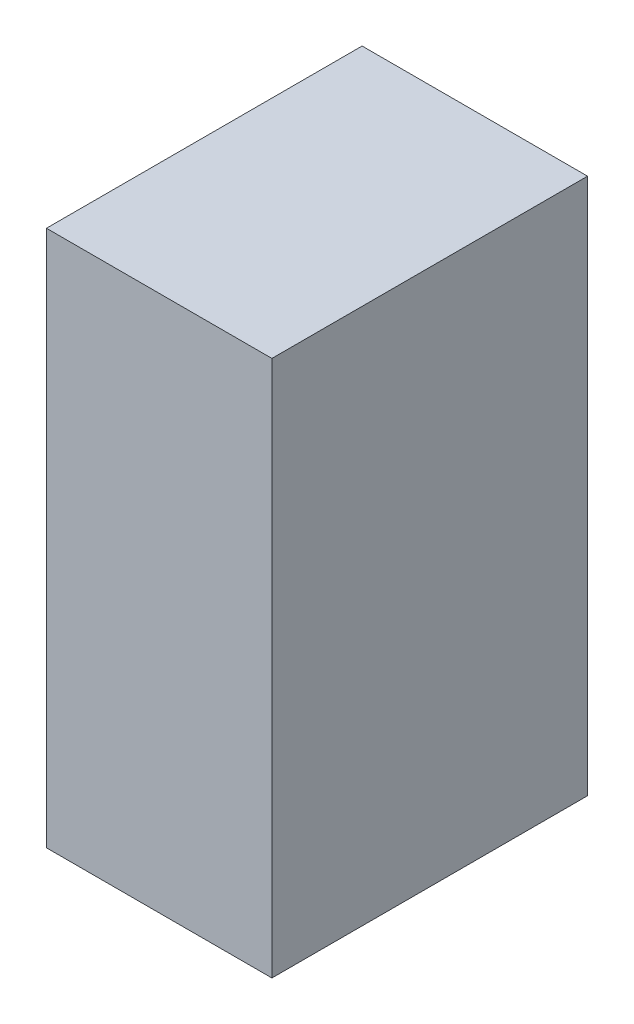
ISO-10303-21;
HEADER;
FILE_DESCRIPTION(('STEP AP214'),'2;1');
FILE_NAME('part.step','',(''),(''),'','','');
FILE_SCHEMA(('AUTOMOTIVE_DESIGN { 1 0 10303 214 1 1 1 1 }'));
ENDSEC;
DATA;
#1=APPLICATION_CONTEXT('core data for automotive mechanical design processes');
#2=APPLICATION_PROTOCOL_DEFINITION('international standard','automotive_design',2000,#1);
#3=PRODUCT_CONTEXT('',#1,'mechanical');
#4=PRODUCT('Part','Part','',(#3));
#5=PRODUCT_RELATED_PRODUCT_CATEGORY('part','',(#4));
#6=PRODUCT_DEFINITION_FORMATION('','',#4);
#7=PRODUCT_DEFINITION_CONTEXT('part definition',#1,'design');
#8=PRODUCT_DEFINITION('design','',#6,#7);
#9=PRODUCT_DEFINITION_SHAPE('','',#8);
#10=(LENGTH_UNIT() NAMED_UNIT(*) SI_UNIT(.MILLI.,.METRE.));
#11=(NAMED_UNIT(*) PLANE_ANGLE_UNIT() SI_UNIT($,.RADIAN.));
#12=(NAMED_UNIT(*) SI_UNIT($,.STERADIAN.) SOLID_ANGLE_UNIT());
#13=UNCERTAINTY_MEASURE_WITH_UNIT(LENGTH_MEASURE(1.E-05),#10,'distance_accuracy_value','');
#14=(GEOMETRIC_REPRESENTATION_CONTEXT(3) GLOBAL_UNCERTAINTY_ASSIGNED_CONTEXT((#13)) GLOBAL_UNIT_ASSIGNED_CONTEXT((#10,
#11,#12)) REPRESENTATION_CONTEXT('',''));
#15=CARTESIAN_POINT('',(0.,0.,0.));
#16=DIRECTION('',(0.,0.,1.));
#17=DIRECTION('',(1.,0.,0.));
#18=AXIS2_PLACEMENT_3D('',#15,#16,#17);
#19=CARTESIAN_POINT('',(-12.5428823982568,625.,35.));
#20=DIRECTION('',(1.,0.,0.));
#21=DIRECTION('',(0.,0.,-1.));
#22=AXIS2_PLACEMENT_3D('',#19,#20,#21);
#23=PLANE('',#22);
#24=DIRECTION('',(0.,-1.,0.));
#25=VECTOR('',#24,1.);
#26=CARTESIAN_POINT('',(-12.5428823982568,625.,0.));
#27=LINE('',#26,#25);
#28=CARTESIAN_POINT('',(-12.5428823982568,625.,0.));
#29=VERTEX_POINT('',#28);
#30=CARTESIAN_POINT('',(-12.5428823982568,565.50237475119,0.));
#31=VERTEX_POINT('',#30);
#32=EDGE_CURVE('E96',#29,#31,#27,.T.);
#33=ORIENTED_EDGE('',*,*,#32,.T.);
#34=DIRECTION('',(0.,0.,-1.));
#35=VECTOR('',#34,1.);
#36=CARTESIAN_POINT('',(-12.5428823982568,565.50237475119,35.));
#37=LINE('',#36,#35);
#38=CARTESIAN_POINT('',(-12.5428823982568,565.50237475119,35.));
#39=VERTEX_POINT('',#38);
#40=EDGE_CURVE('E11',#39,#31,#37,.T.);
#41=ORIENTED_EDGE('',*,*,#40,.F.);
#42=DIRECTION('',(0.,-1.,0.));
#43=VECTOR('',#42,1.);
#44=CARTESIAN_POINT('',(-12.5428823982568,625.,35.));
#45=LINE('',#44,#43);
#46=CARTESIAN_POINT('',(-12.5428823982568,625.,35.));
#47=VERTEX_POINT('',#46);
#48=EDGE_CURVE('E84',#47,#39,#45,.T.);
#49=ORIENTED_EDGE('',*,*,#48,.F.);
#50=DIRECTION('',(0.,0.,-1.));
#51=VECTOR('',#50,1.);
#52=CARTESIAN_POINT('',(-12.5428823982568,625.,35.));
#53=LINE('',#52,#51);
#54=EDGE_CURVE('E92',#47,#29,#53,.T.);
#55=ORIENTED_EDGE('',*,*,#54,.T.);
#56=EDGE_LOOP('',(#33,#41,#49,#55));
#57=FACE_BOUND('',#56,.T.);
#58=ADVANCED_FACE('F33',(#57),#23,.F.);
#59=CARTESIAN_POINT('',(-12.5428823982568,565.50237475119,35.));
#60=DIRECTION('',(0.,1.,0.));
#61=DIRECTION('',(0.,0.,1.));
#62=AXIS2_PLACEMENT_3D('',#59,#60,#61);
#63=PLANE('',#62);
#64=DIRECTION('',(1.,0.,0.));
#65=VECTOR('',#64,1.);
#66=CARTESIAN_POINT('',(-12.5428823982568,565.50237475119,0.));
#67=LINE('',#66,#65);
#68=CARTESIAN_POINT('',(12.4571176017432,565.50237475119,0.));
#69=VERTEX_POINT('',#68);
#70=EDGE_CURVE('E88',#31,#69,#67,.T.);
#71=ORIENTED_EDGE('',*,*,#70,.T.);
#72=DIRECTION('',(0.,0.,-1.));
#73=VECTOR('',#72,1.);
#74=CARTESIAN_POINT('',(12.4571176017432,565.50237475119,35.));
#75=LINE('',#74,#73);
#76=CARTESIAN_POINT('',(12.4571176017432,565.50237475119,35.));
#77=VERTEX_POINT('',#76);
#78=EDGE_CURVE('E41',#77,#69,#75,.T.);
#79=ORIENTED_EDGE('',*,*,#78,.F.);
#80=DIRECTION('',(1.,0.,0.));
#81=VECTOR('',#80,1.);
#82=CARTESIAN_POINT('',(-12.5428823982568,565.50237475119,35.));
#83=LINE('',#82,#81);
#84=EDGE_CURVE('E79',#39,#77,#83,.T.);
#85=ORIENTED_EDGE('',*,*,#84,.F.);
#86=ORIENTED_EDGE('',*,*,#40,.T.);
#87=EDGE_LOOP('',(#71,#79,#85,#86));
#88=FACE_BOUND('',#87,.T.);
#89=ADVANCED_FACE('F87',(#88),#63,.F.);
#90=CARTESIAN_POINT('',(12.4571176017432,625.,35.));
#91=DIRECTION('',(-1.,0.,0.));
#92=DIRECTION('',(0.,0.,1.));
#93=AXIS2_PLACEMENT_3D('',#90,#91,#92);
#94=PLANE('',#93);
#95=DIRECTION('',(0.,1.,0.));
#96=VECTOR('',#95,1.);
#97=CARTESIAN_POINT('',(12.4571176017432,625.,0.));
#98=LINE('',#97,#96);
#99=CARTESIAN_POINT('',(12.4571176017432,625.,0.));
#100=VERTEX_POINT('',#99);
#101=EDGE_CURVE('E66',#69,#100,#98,.T.);
#102=ORIENTED_EDGE('',*,*,#101,.T.);
#103=DIRECTION('',(0.,0.,-1.));
#104=VECTOR('',#103,1.);
#105=CARTESIAN_POINT('',(12.4571176017432,625.,35.));
#106=LINE('',#105,#104);
#107=CARTESIAN_POINT('',(12.4571176017432,625.,35.));
#108=VERTEX_POINT('',#107);
#109=EDGE_CURVE('E89',#108,#100,#106,.T.);
#110=ORIENTED_EDGE('',*,*,#109,.F.);
#111=DIRECTION('',(0.,1.,0.));
#112=VECTOR('',#111,1.);
#113=CARTESIAN_POINT('',(12.4571176017432,625.,35.));
#114=LINE('',#113,#112);
#115=EDGE_CURVE('E82',#77,#108,#114,.T.);
#116=ORIENTED_EDGE('',*,*,#115,.F.);
#117=ORIENTED_EDGE('',*,*,#78,.T.);
#118=EDGE_LOOP('',(#102,#110,#116,#117));
#119=FACE_BOUND('',#118,.T.);
#120=ADVANCED_FACE('F90',(#119),#94,.F.);
#121=CARTESIAN_POINT('',(-12.5428823982568,625.,35.));
#122=DIRECTION('',(0.,-1.,0.));
#123=DIRECTION('',(0.,0.,-1.));
#124=AXIS2_PLACEMENT_3D('',#121,#122,#123);
#125=PLANE('',#124);
#126=DIRECTION('',(-1.,0.,0.));
#127=VECTOR('',#126,1.);
#128=CARTESIAN_POINT('',(-12.5428823982568,625.,0.));
#129=LINE('',#128,#127);
#130=EDGE_CURVE('E72',#100,#29,#129,.T.);
#131=ORIENTED_EDGE('',*,*,#130,.T.);
#132=ORIENTED_EDGE('',*,*,#54,.F.);
#133=DIRECTION('',(-1.,0.,0.));
#134=VECTOR('',#133,1.);
#135=CARTESIAN_POINT('',(-12.5428823982568,625.,35.));
#136=LINE('',#135,#134);
#137=EDGE_CURVE('E49',#108,#47,#136,.T.);
#138=ORIENTED_EDGE('',*,*,#137,.F.);
#139=ORIENTED_EDGE('',*,*,#109,.T.);
#140=EDGE_LOOP('',(#131,#132,#138,#139));
#141=FACE_BOUND('',#140,.T.);
#142=ADVANCED_FACE('F103',(#141),#125,.F.);
#143=CARTESIAN_POINT('',(0.,0.,35.));
#144=DIRECTION('',(0.,0.,1.));
#145=DIRECTION('',(1.,0.,0.));
#146=AXIS2_PLACEMENT_3D('',#143,#144,#145);
#147=PLANE('',#146);
#148=ORIENTED_EDGE('',*,*,#48,.T.);
#149=ORIENTED_EDGE('',*,*,#84,.T.);
#150=ORIENTED_EDGE('',*,*,#115,.T.);
#151=ORIENTED_EDGE('',*,*,#137,.T.);
#152=EDGE_LOOP('',(#148,#149,#150,#151));
#153=FACE_BOUND('',#152,.T.);
#154=ADVANCED_FACE('F80',(#153),#147,.T.);
#155=CARTESIAN_POINT('',(0.,0.,0.));
#156=DIRECTION('',(0.,0.,1.));
#157=DIRECTION('',(1.,0.,0.));
#158=AXIS2_PLACEMENT_3D('',#155,#156,#157);
#159=PLANE('',#158);
#160=ORIENTED_EDGE('',*,*,#32,.F.);
#161=ORIENTED_EDGE('',*,*,#130,.F.);
#162=ORIENTED_EDGE('',*,*,#101,.F.);
#163=ORIENTED_EDGE('',*,*,#70,.F.);
#164=EDGE_LOOP('',(#160,#161,#162,#163));
#165=FACE_BOUND('',#164,.T.);
#166=ADVANCED_FACE('F106',(#165),#159,.F.);
#167=CLOSED_SHELL('',(#58,#89,#120,#142,#154,#166));
#168=MANIFOLD_SOLID_BREP('B2',#167);
#169=ADVANCED_BREP_SHAPE_REPRESENTATION('',(#18,#168),#14);
#170=SHAPE_DEFINITION_REPRESENTATION(#9,#169);
ENDSEC;
END-ISO-10303-21;
